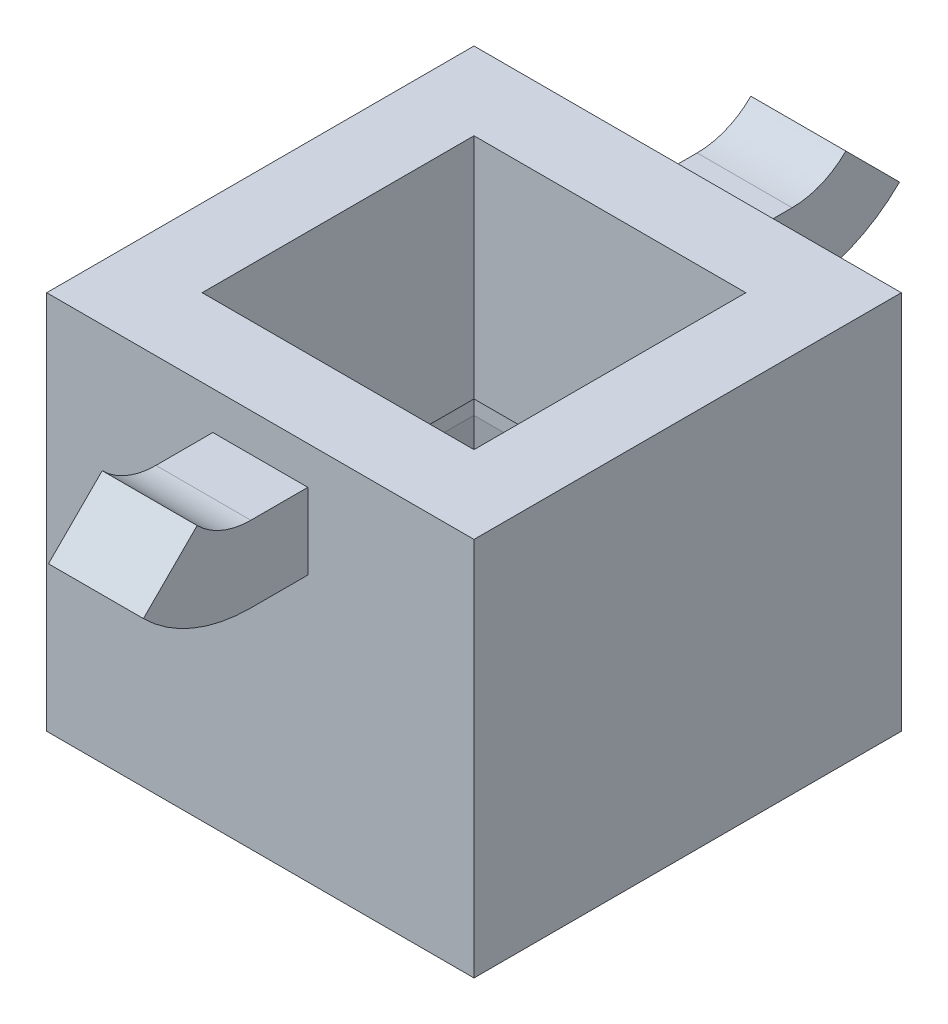
ISO-10303-21;
HEADER;
FILE_DESCRIPTION(('STEP AP214'),'2;1');
FILE_NAME('part.step','',(''),(''),'','','');
FILE_SCHEMA(('AUTOMOTIVE_DESIGN { 1 0 10303 214 1 1 1 1 }'));
ENDSEC;
DATA;
#1=APPLICATION_CONTEXT('core data for automotive mechanical design processes');
#2=APPLICATION_PROTOCOL_DEFINITION('international standard','automotive_design',2000,#1);
#3=PRODUCT_CONTEXT('',#1,'mechanical');
#4=PRODUCT('Part','Part','',(#3));
#5=PRODUCT_RELATED_PRODUCT_CATEGORY('part','',(#4));
#6=PRODUCT_DEFINITION_FORMATION('','',#4);
#7=PRODUCT_DEFINITION_CONTEXT('part definition',#1,'design');
#8=PRODUCT_DEFINITION('design','',#6,#7);
#9=PRODUCT_DEFINITION_SHAPE('','',#8);
#10=(LENGTH_UNIT() NAMED_UNIT(*) SI_UNIT(.MILLI.,.METRE.));
#11=(NAMED_UNIT(*) PLANE_ANGLE_UNIT() SI_UNIT($,.RADIAN.));
#12=(NAMED_UNIT(*) SI_UNIT($,.STERADIAN.) SOLID_ANGLE_UNIT());
#13=UNCERTAINTY_MEASURE_WITH_UNIT(LENGTH_MEASURE(1.E-05),#10,'distance_accuracy_value','');
#14=(GEOMETRIC_REPRESENTATION_CONTEXT(3) GLOBAL_UNCERTAINTY_ASSIGNED_CONTEXT((#13)) GLOBAL_UNIT_ASSIGNED_CONTEXT((#10,
#11,#12)) REPRESENTATION_CONTEXT('',''));
#15=CARTESIAN_POINT('',(0.,0.,0.));
#16=DIRECTION('',(0.,0.,1.));
#17=DIRECTION('',(1.,0.,0.));
#18=AXIS2_PLACEMENT_3D('',#15,#16,#17);
#19=CARTESIAN_POINT('',(11.25,20.,-11.25));
#20=DIRECTION('',(0.,0.,1.));
#21=DIRECTION('',(1.,0.,0.));
#22=AXIS2_PLACEMENT_3D('',#19,#20,#21);
#23=PLANE('',#22);
#24=DIRECTION('',(-1.,0.,0.));
#25=VECTOR('',#24,1.);
#26=CARTESIAN_POINT('',(11.25,0.,-11.25));
#27=LINE('',#26,#25);
#28=CARTESIAN_POINT('',(11.25,0.,-11.25));
#29=VERTEX_POINT('',#28);
#30=CARTESIAN_POINT('',(-11.25,0.,-11.25));
#31=VERTEX_POINT('',#30);
#32=EDGE_CURVE('E398',#29,#31,#27,.T.);
#33=ORIENTED_EDGE('',*,*,#32,.T.);
#34=DIRECTION('',(0.,-1.,0.));
#35=VECTOR('',#34,1.);
#36=CARTESIAN_POINT('',(-11.25,20.,-11.25));
#37=LINE('',#36,#35);
#38=CARTESIAN_POINT('',(-11.25,20.,-11.25));
#39=VERTEX_POINT('',#38);
#40=EDGE_CURVE('E404',#39,#31,#37,.T.);
#41=ORIENTED_EDGE('',*,*,#40,.F.);
#42=DIRECTION('',(-1.,0.,0.));
#43=VECTOR('',#42,1.);
#44=CARTESIAN_POINT('',(11.25,20.,-11.25));
#45=LINE('',#44,#43);
#46=CARTESIAN_POINT('',(11.25,20.,-11.25));
#47=VERTEX_POINT('',#46);
#48=EDGE_CURVE('E402',#47,#39,#45,.T.);
#49=ORIENTED_EDGE('',*,*,#48,.F.);
#50=DIRECTION('',(0.,-1.,0.));
#51=VECTOR('',#50,1.);
#52=CARTESIAN_POINT('',(11.25,20.,-11.25));
#53=LINE('',#52,#51);
#54=EDGE_CURVE('E414',#47,#29,#53,.T.);
#55=ORIENTED_EDGE('',*,*,#54,.T.);
#56=EDGE_LOOP('',(#33,#41,#49,#55));
#57=FACE_BOUND('',#56,.T.);
#58=DIRECTION('',(0.,-1.,0.));
#59=VECTOR('',#58,1.);
#60=CARTESIAN_POINT('',(2.50000000000001,18.,-11.25));
#61=LINE('',#60,#59);
#62=CARTESIAN_POINT('',(2.50000000000001,18.,-11.25));
#63=VERTEX_POINT('',#62);
#64=CARTESIAN_POINT('',(2.50000000000001,14.,-11.25));
#65=VERTEX_POINT('',#64);
#66=EDGE_CURVE('E339',#63,#65,#61,.T.);
#67=ORIENTED_EDGE('',*,*,#66,.F.);
#68=DIRECTION('',(1.,0.,0.));
#69=VECTOR('',#68,1.);
#70=CARTESIAN_POINT('',(-2.49999999999999,18.,-11.25));
#71=LINE('',#70,#69);
#72=CARTESIAN_POINT('',(-2.5,18.,-11.25));
#73=VERTEX_POINT('',#72);
#74=EDGE_CURVE('E344',#73,#63,#71,.T.);
#75=ORIENTED_EDGE('',*,*,#74,.F.);
#76=DIRECTION('',(0.,1.,0.));
#77=VECTOR('',#76,1.);
#78=CARTESIAN_POINT('',(-2.49999999999999,18.,-11.25));
#79=LINE('',#78,#77);
#80=CARTESIAN_POINT('',(-2.5,14.,-11.25));
#81=VERTEX_POINT('',#80);
#82=EDGE_CURVE('E353',#81,#73,#79,.T.);
#83=ORIENTED_EDGE('',*,*,#82,.F.);
#84=DIRECTION('',(-1.,0.,0.));
#85=VECTOR('',#84,1.);
#86=CARTESIAN_POINT('',(-2.49999999999999,14.,-11.25));
#87=LINE('',#86,#85);
#88=EDGE_CURVE('E350',#65,#81,#87,.T.);
#89=ORIENTED_EDGE('',*,*,#88,.F.);
#90=EDGE_LOOP('',(#67,#75,#83,#89));
#91=FACE_BOUND('',#90,.T.);
#92=ADVANCED_FACE('F33',(#57,#91),#23,.F.);
#93=CARTESIAN_POINT('',(-11.25,20.,11.25));
#94=DIRECTION('',(1.,0.,0.));
#95=DIRECTION('',(0.,0.,-1.));
#96=AXIS2_PLACEMENT_3D('',#93,#94,#95);
#97=PLANE('',#96);
#98=DIRECTION('',(0.,0.,1.));
#99=VECTOR('',#98,1.);
#100=CARTESIAN_POINT('',(-11.25,0.,11.25));
#101=LINE('',#100,#99);
#102=CARTESIAN_POINT('',(-11.25,0.,11.25));
#103=VERTEX_POINT('',#102);
#104=EDGE_CURVE('E393',#31,#103,#101,.T.);
#105=ORIENTED_EDGE('',*,*,#104,.T.);
#106=DIRECTION('',(0.,-1.,0.));
#107=VECTOR('',#106,1.);
#108=CARTESIAN_POINT('',(-11.25,20.,11.25));
#109=LINE('',#108,#107);
#110=CARTESIAN_POINT('',(-11.25,20.,11.25));
#111=VERTEX_POINT('',#110);
#112=EDGE_CURVE('E11',#111,#103,#109,.T.);
#113=ORIENTED_EDGE('',*,*,#112,.F.);
#114=DIRECTION('',(0.,0.,1.));
#115=VECTOR('',#114,1.);
#116=CARTESIAN_POINT('',(-11.25,20.,11.25));
#117=LINE('',#116,#115);
#118=EDGE_CURVE('E394',#39,#111,#117,.T.);
#119=ORIENTED_EDGE('',*,*,#118,.F.);
#120=ORIENTED_EDGE('',*,*,#40,.T.);
#121=EDGE_LOOP('',(#105,#113,#119,#120));
#122=FACE_BOUND('',#121,.T.);
#123=ADVANCED_FACE('F35',(#122),#97,.F.);
#124=CARTESIAN_POINT('',(11.25,20.,11.25));
#125=DIRECTION('',(0.,0.,-1.));
#126=DIRECTION('',(-1.,0.,0.));
#127=AXIS2_PLACEMENT_3D('',#124,#125,#126);
#128=PLANE('',#127);
#129=DIRECTION('',(1.,0.,0.));
#130=VECTOR('',#129,1.);
#131=CARTESIAN_POINT('',(-2.49999999999999,18.,11.25));
#132=LINE('',#131,#130);
#133=CARTESIAN_POINT('',(-2.49999999999999,18.,11.25));
#134=VERTEX_POINT('',#133);
#135=CARTESIAN_POINT('',(2.50000000000001,18.,11.25));
#136=VERTEX_POINT('',#135);
#137=EDGE_CURVE('E303',#134,#136,#132,.T.);
#138=ORIENTED_EDGE('',*,*,#137,.T.);
#139=DIRECTION('',(0.,-1.,0.));
#140=VECTOR('',#139,1.);
#141=CARTESIAN_POINT('',(2.50000000000001,18.,11.25));
#142=LINE('',#141,#140);
#143=CARTESIAN_POINT('',(2.5,14.,11.25));
#144=VERTEX_POINT('',#143);
#145=EDGE_CURVE('E275',#136,#144,#142,.T.);
#146=ORIENTED_EDGE('',*,*,#145,.T.);
#147=DIRECTION('',(-1.,0.,0.));
#148=VECTOR('',#147,1.);
#149=CARTESIAN_POINT('',(-2.49999999999999,14.,11.25));
#150=LINE('',#149,#148);
#151=CARTESIAN_POINT('',(-2.5,14.,11.25));
#152=VERTEX_POINT('',#151);
#153=EDGE_CURVE('E297',#144,#152,#150,.T.);
#154=ORIENTED_EDGE('',*,*,#153,.T.);
#155=DIRECTION('',(0.,1.,0.));
#156=VECTOR('',#155,1.);
#157=CARTESIAN_POINT('',(-2.49999999999999,18.,11.25));
#158=LINE('',#157,#156);
#159=EDGE_CURVE('E306',#152,#134,#158,.T.);
#160=ORIENTED_EDGE('',*,*,#159,.T.);
#161=EDGE_LOOP('',(#138,#146,#154,#160));
#162=FACE_BOUND('',#161,.T.);
#163=DIRECTION('',(1.,0.,0.));
#164=VECTOR('',#163,1.);
#165=CARTESIAN_POINT('',(11.25,0.,11.25));
#166=LINE('',#165,#164);
#167=CARTESIAN_POINT('',(11.25,0.,11.25));
#168=VERTEX_POINT('',#167);
#169=EDGE_CURVE('E407',#103,#168,#166,.T.);
#170=ORIENTED_EDGE('',*,*,#169,.T.);
#171=DIRECTION('',(0.,-1.,0.));
#172=VECTOR('',#171,1.);
#173=CARTESIAN_POINT('',(11.25,20.,11.25));
#174=LINE('',#173,#172);
#175=CARTESIAN_POINT('',(11.25,20.,11.25));
#176=VERTEX_POINT('',#175);
#177=EDGE_CURVE('E41',#176,#168,#174,.T.);
#178=ORIENTED_EDGE('',*,*,#177,.F.);
#179=DIRECTION('',(1.,0.,0.));
#180=VECTOR('',#179,1.);
#181=CARTESIAN_POINT('',(11.25,20.,11.25));
#182=LINE('',#181,#180);
#183=EDGE_CURVE('E397',#111,#176,#182,.T.);
#184=ORIENTED_EDGE('',*,*,#183,.F.);
#185=ORIENTED_EDGE('',*,*,#112,.T.);
#186=EDGE_LOOP('',(#170,#178,#184,#185));
#187=FACE_BOUND('',#186,.T.);
#188=ADVANCED_FACE('F435',(#162,#187),#128,.F.);
#189=CARTESIAN_POINT('',(11.25,20.,11.25));
#190=DIRECTION('',(-1.,0.,0.));
#191=DIRECTION('',(0.,0.,1.));
#192=AXIS2_PLACEMENT_3D('',#189,#190,#191);
#193=PLANE('',#192);
#194=DIRECTION('',(0.,0.,-1.));
#195=VECTOR('',#194,1.);
#196=CARTESIAN_POINT('',(11.25,0.,11.25));
#197=LINE('',#196,#195);
#198=EDGE_CURVE('E409',#168,#29,#197,.T.);
#199=ORIENTED_EDGE('',*,*,#198,.T.);
#200=ORIENTED_EDGE('',*,*,#54,.F.);
#201=DIRECTION('',(0.,0.,-1.));
#202=VECTOR('',#201,1.);
#203=CARTESIAN_POINT('',(11.25,20.,11.25));
#204=LINE('',#203,#202);
#205=EDGE_CURVE('E400',#176,#47,#204,.T.);
#206=ORIENTED_EDGE('',*,*,#205,.F.);
#207=ORIENTED_EDGE('',*,*,#177,.T.);
#208=EDGE_LOOP('',(#199,#200,#206,#207));
#209=FACE_BOUND('',#208,.T.);
#210=ADVANCED_FACE('F421',(#209),#193,.F.);
#211=CARTESIAN_POINT('',(0.,20.,0.));
#212=DIRECTION('',(0.,1.,0.));
#213=DIRECTION('',(0.,0.,1.));
#214=AXIS2_PLACEMENT_3D('',#211,#212,#213);
#215=PLANE('',#214);
#216=DIRECTION('',(0.,0.,-1.));
#217=VECTOR('',#216,1.);
#218=CARTESIAN_POINT('',(-7.15675499178565,20.,-7.15675499178565));
#219=LINE('',#218,#217);
#220=CARTESIAN_POINT('',(-7.15675499178565,20.,7.15675499178565));
#221=VERTEX_POINT('',#220);
#222=CARTESIAN_POINT('',(-7.15675499178565,20.,-7.15675499178565));
#223=VERTEX_POINT('',#222);
#224=EDGE_CURVE('E216',#221,#223,#219,.T.);
#225=ORIENTED_EDGE('',*,*,#224,.T.);
#226=DIRECTION('',(1.,0.,0.));
#227=VECTOR('',#226,1.);
#228=CARTESIAN_POINT('',(7.15675499178565,20.,-7.15675499178565));
#229=LINE('',#228,#227);
#230=CARTESIAN_POINT('',(7.15675499178565,20.,-7.15675499178565));
#231=VERTEX_POINT('',#230);
#232=EDGE_CURVE('E205',#223,#231,#229,.T.);
#233=ORIENTED_EDGE('',*,*,#232,.T.);
#234=DIRECTION('',(0.,0.,1.));
#235=VECTOR('',#234,1.);
#236=CARTESIAN_POINT('',(7.15675499178565,20.,-7.15675499178565));
#237=LINE('',#236,#235);
#238=CARTESIAN_POINT('',(7.15675499178565,20.,7.15675499178565));
#239=VERTEX_POINT('',#238);
#240=EDGE_CURVE('E227',#231,#239,#237,.T.);
#241=ORIENTED_EDGE('',*,*,#240,.T.);
#242=DIRECTION('',(-1.,0.,0.));
#243=VECTOR('',#242,1.);
#244=CARTESIAN_POINT('',(7.15675499178565,20.,7.15675499178565));
#245=LINE('',#244,#243);
#246=EDGE_CURVE('E223',#239,#221,#245,.T.);
#247=ORIENTED_EDGE('',*,*,#246,.T.);
#248=EDGE_LOOP('',(#225,#233,#241,#247));
#249=FACE_BOUND('',#248,.T.);
#250=ORIENTED_EDGE('',*,*,#118,.T.);
#251=ORIENTED_EDGE('',*,*,#183,.T.);
#252=ORIENTED_EDGE('',*,*,#205,.T.);
#253=ORIENTED_EDGE('',*,*,#48,.T.);
#254=EDGE_LOOP('',(#250,#251,#252,#253));
#255=FACE_BOUND('',#254,.T.);
#256=ADVANCED_FACE('F221',(#249,#255),#215,.T.);
#257=CARTESIAN_POINT('',(0.,0.,0.));
#258=DIRECTION('',(0.,1.,0.));
#259=DIRECTION('',(0.,0.,1.));
#260=AXIS2_PLACEMENT_3D('',#257,#258,#259);
#261=PLANE('',#260);
#262=DIRECTION('',(-1.,0.,0.));
#263=VECTOR('',#262,1.);
#264=CARTESIAN_POINT('',(-9.25,0.,9.25));
#265=LINE('',#264,#263);
#266=CARTESIAN_POINT('',(9.25,0.,9.25));
#267=VERTEX_POINT('',#266);
#268=CARTESIAN_POINT('',(-9.25,0.,9.25));
#269=VERTEX_POINT('',#268);
#270=EDGE_CURVE('E263',#267,#269,#265,.T.);
#271=ORIENTED_EDGE('',*,*,#270,.F.);
#272=DIRECTION('',(0.,0.,1.));
#273=VECTOR('',#272,1.);
#274=CARTESIAN_POINT('',(9.25,0.,-9.25));
#275=LINE('',#274,#273);
#276=CARTESIAN_POINT('',(9.25,0.,-9.25));
#277=VERTEX_POINT('',#276);
#278=EDGE_CURVE('E255',#277,#267,#275,.T.);
#279=ORIENTED_EDGE('',*,*,#278,.F.);
#280=DIRECTION('',(1.,0.,0.));
#281=VECTOR('',#280,1.);
#282=CARTESIAN_POINT('',(-9.25,0.,-9.25));
#283=LINE('',#282,#281);
#284=CARTESIAN_POINT('',(-9.25,0.,-9.25));
#285=VERTEX_POINT('',#284);
#286=EDGE_CURVE('E269',#285,#277,#283,.T.);
#287=ORIENTED_EDGE('',*,*,#286,.F.);
#288=DIRECTION('',(0.,0.,-1.));
#289=VECTOR('',#288,1.);
#290=CARTESIAN_POINT('',(-9.25,0.,-9.25));
#291=LINE('',#290,#289);
#292=EDGE_CURVE('E266',#269,#285,#291,.T.);
#293=ORIENTED_EDGE('',*,*,#292,.F.);
#294=EDGE_LOOP('',(#271,#279,#287,#293));
#295=FACE_BOUND('',#294,.T.);
#296=ORIENTED_EDGE('',*,*,#104,.F.);
#297=ORIENTED_EDGE('',*,*,#32,.F.);
#298=ORIENTED_EDGE('',*,*,#198,.F.);
#299=ORIENTED_EDGE('',*,*,#169,.F.);
#300=EDGE_LOOP('',(#296,#297,#298,#299));
#301=FACE_BOUND('',#300,.T.);
#302=ADVANCED_FACE('F427',(#295,#301),#261,.F.);
#303=CARTESIAN_POINT('',(0.,22.,-14.25));
#304=DIRECTION('',(1.,0.,0.));
#305=DIRECTION('',(0.,0.,-1.));
#306=AXIS2_PLACEMENT_3D('',#303,#304,#305);
#307=CYLINDRICAL_SURFACE('',#306,8.);
#308=DIRECTION('',(-1.,0.,0.));
#309=VECTOR('',#308,1.);
#310=CARTESIAN_POINT('',(-2.49999999999999,14.,-14.25));
#311=LINE('',#310,#309);
#312=CARTESIAN_POINT('',(2.5,14.,-14.25));
#313=VERTEX_POINT('',#312);
#314=CARTESIAN_POINT('',(-2.49999999999999,14.,-14.25));
#315=VERTEX_POINT('',#314);
#316=EDGE_CURVE('E340',#313,#315,#311,.T.);
#317=ORIENTED_EDGE('',*,*,#316,.T.);
#318=CARTESIAN_POINT('',(-2.49999999999999,22.,-14.25));
#319=DIRECTION('',(1.,0.,0.));
#320=DIRECTION('',(0.,0.,-1.));
#321=AXIS2_PLACEMENT_3D('',#318,#319,#320);
#322=CIRCLE('',#321,8.);
#323=CARTESIAN_POINT('',(-2.49999999999999,16.3431457505076,-19.9068542494923));
#324=VERTEX_POINT('',#323);
#325=EDGE_CURVE('E387',#315,#324,#322,.T.);
#326=ORIENTED_EDGE('',*,*,#325,.T.);
#327=DIRECTION('',(-1.,0.,0.));
#328=VECTOR('',#327,1.);
#329=CARTESIAN_POINT('',(-2.49999999999999,16.3431457505076,-19.9068542494923));
#330=LINE('',#329,#328);
#331=CARTESIAN_POINT('',(2.5,16.3431457505076,-19.9068542494923));
#332=VERTEX_POINT('',#331);
#333=EDGE_CURVE('E378',#332,#324,#330,.T.);
#334=ORIENTED_EDGE('',*,*,#333,.F.);
#335=CARTESIAN_POINT('',(2.5,22.,-14.25));
#336=DIRECTION('',(1.,0.,0.));
#337=DIRECTION('',(0.,0.,-1.));
#338=AXIS2_PLACEMENT_3D('',#335,#336,#337);
#339=CIRCLE('',#338,8.);
#340=EDGE_CURVE('E390',#313,#332,#339,.T.);
#341=ORIENTED_EDGE('',*,*,#340,.F.);
#342=EDGE_LOOP('',(#317,#326,#334,#341));
#343=FACE_BOUND('',#342,.T.);
#344=ADVANCED_FACE('F450',(#343),#307,.T.);
#345=CARTESIAN_POINT('',(0.,22.,-14.25));
#346=DIRECTION('',(1.,0.,0.));
#347=DIRECTION('',(0.,0.,-1.));
#348=AXIS2_PLACEMENT_3D('',#345,#346,#347);
#349=CYLINDRICAL_SURFACE('',#348,4.);
#350=DIRECTION('',(1.,0.,0.));
#351=VECTOR('',#350,1.);
#352=CARTESIAN_POINT('',(-2.49999999999999,18.,-14.25));
#353=LINE('',#352,#351);
#354=CARTESIAN_POINT('',(-2.49999999999999,18.,-14.25));
#355=VERTEX_POINT('',#354);
#356=CARTESIAN_POINT('',(2.50000000000001,18.,-14.25));
#357=VERTEX_POINT('',#356);
#358=EDGE_CURVE('E343',#355,#357,#353,.T.);
#359=ORIENTED_EDGE('',*,*,#358,.T.);
#360=CARTESIAN_POINT('',(2.50000000000001,22.,-14.25));
#361=DIRECTION('',(1.,0.,0.));
#362=DIRECTION('',(0.,0.,-1.));
#363=AXIS2_PLACEMENT_3D('',#360,#361,#362);
#364=CIRCLE('',#363,4.);
#365=CARTESIAN_POINT('',(2.50000000000001,19.1715728752538,-17.0784271247462));
#366=VERTEX_POINT('',#365);
#367=EDGE_CURVE('E381',#357,#366,#364,.T.);
#368=ORIENTED_EDGE('',*,*,#367,.T.);
#369=DIRECTION('',(1.,0.,0.));
#370=VECTOR('',#369,1.);
#371=CARTESIAN_POINT('',(-2.49999999999999,19.1715728752538,-17.0784271247462));
#372=LINE('',#371,#370);
#373=CARTESIAN_POINT('',(-2.49999999999999,19.1715728752538,-17.0784271247462));
#374=VERTEX_POINT('',#373);
#375=EDGE_CURVE('E372',#374,#366,#372,.T.);
#376=ORIENTED_EDGE('',*,*,#375,.F.);
#377=CARTESIAN_POINT('',(-2.49999999999999,22.,-14.25));
#378=DIRECTION('',(1.,0.,0.));
#379=DIRECTION('',(0.,0.,-1.));
#380=AXIS2_PLACEMENT_3D('',#377,#378,#379);
#381=CIRCLE('',#380,4.);
#382=EDGE_CURVE('E384',#355,#374,#381,.T.);
#383=ORIENTED_EDGE('',*,*,#382,.F.);
#384=EDGE_LOOP('',(#359,#368,#376,#383));
#385=FACE_BOUND('',#384,.T.);
#386=ADVANCED_FACE('F456',(#385),#349,.F.);
#387=CARTESIAN_POINT('',(2.50000000000001,18.,-14.25));
#388=DIRECTION('',(-1.,0.,0.));
#389=DIRECTION('',(0.,-1.,0.));
#390=AXIS2_PLACEMENT_3D('',#387,#388,#389);
#391=PLANE('',#390);
#392=ORIENTED_EDGE('',*,*,#66,.T.);
#393=DIRECTION('',(0.,0.,1.));
#394=VECTOR('',#393,1.);
#395=CARTESIAN_POINT('',(2.5,14.,-14.25));
#396=LINE('',#395,#394);
#397=EDGE_CURVE('E366',#313,#65,#396,.T.);
#398=ORIENTED_EDGE('',*,*,#397,.F.);
#399=ORIENTED_EDGE('',*,*,#340,.T.);
#400=DIRECTION('',(0.,-0.707106781186554,-0.707106781186541));
#401=VECTOR('',#400,1.);
#402=CARTESIAN_POINT('',(2.50000000000001,19.1715728752538,-17.0784271247462));
#403=LINE('',#402,#401);
#404=EDGE_CURVE('E369',#366,#332,#403,.T.);
#405=ORIENTED_EDGE('',*,*,#404,.F.);
#406=ORIENTED_EDGE('',*,*,#367,.F.);
#407=DIRECTION('',(0.,0.,1.));
#408=VECTOR('',#407,1.);
#409=CARTESIAN_POINT('',(2.50000000000001,18.,-14.25));
#410=LINE('',#409,#408);
#411=EDGE_CURVE('E347',#357,#63,#410,.T.);
#412=ORIENTED_EDGE('',*,*,#411,.T.);
#413=EDGE_LOOP('',(#392,#398,#399,#405,#406,#412));
#414=FACE_BOUND('',#413,.T.);
#415=ADVANCED_FACE('F460',(#414),#391,.F.);
#416=CARTESIAN_POINT('',(-2.49999999999999,14.,-14.25));
#417=DIRECTION('',(0.,1.,0.));
#418=DIRECTION('',(0.,0.,1.));
#419=AXIS2_PLACEMENT_3D('',#416,#417,#418);
#420=PLANE('',#419);
#421=ORIENTED_EDGE('',*,*,#88,.T.);
#422=DIRECTION('',(0.,0.,1.));
#423=VECTOR('',#422,1.);
#424=CARTESIAN_POINT('',(-2.49999999999999,14.,-14.25));
#425=LINE('',#424,#423);
#426=EDGE_CURVE('E363',#315,#81,#425,.T.);
#427=ORIENTED_EDGE('',*,*,#426,.F.);
#428=ORIENTED_EDGE('',*,*,#316,.F.);
#429=ORIENTED_EDGE('',*,*,#397,.T.);
#430=EDGE_LOOP('',(#421,#427,#428,#429));
#431=FACE_BOUND('',#430,.T.);
#432=ADVANCED_FACE('F464',(#431),#420,.F.);
#433=CARTESIAN_POINT('',(-2.49999999999999,18.,-14.25));
#434=DIRECTION('',(1.,0.,0.));
#435=DIRECTION('',(0.,0.,-1.));
#436=AXIS2_PLACEMENT_3D('',#433,#434,#435);
#437=PLANE('',#436);
#438=ORIENTED_EDGE('',*,*,#82,.T.);
#439=DIRECTION('',(0.,0.,1.));
#440=VECTOR('',#439,1.);
#441=CARTESIAN_POINT('',(-2.49999999999999,18.,-14.25));
#442=LINE('',#441,#440);
#443=EDGE_CURVE('E360',#355,#73,#442,.T.);
#444=ORIENTED_EDGE('',*,*,#443,.F.);
#445=ORIENTED_EDGE('',*,*,#382,.T.);
#446=DIRECTION('',(0.,0.707106781186554,0.707106781186541));
#447=VECTOR('',#446,1.);
#448=CARTESIAN_POINT('',(-2.49999999999999,19.1715728752538,-17.0784271247462));
#449=LINE('',#448,#447);
#450=EDGE_CURVE('E375',#324,#374,#449,.T.);
#451=ORIENTED_EDGE('',*,*,#450,.F.);
#452=ORIENTED_EDGE('',*,*,#325,.F.);
#453=ORIENTED_EDGE('',*,*,#426,.T.);
#454=EDGE_LOOP('',(#438,#444,#445,#451,#452,#453));
#455=FACE_BOUND('',#454,.T.);
#456=ADVANCED_FACE('F468',(#455),#437,.F.);
#457=CARTESIAN_POINT('',(-2.49999999999999,18.,-14.25));
#458=DIRECTION('',(0.,-1.,0.));
#459=DIRECTION('',(0.,0.,-1.));
#460=AXIS2_PLACEMENT_3D('',#457,#458,#459);
#461=PLANE('',#460);
#462=ORIENTED_EDGE('',*,*,#74,.T.);
#463=ORIENTED_EDGE('',*,*,#411,.F.);
#464=ORIENTED_EDGE('',*,*,#358,.F.);
#465=ORIENTED_EDGE('',*,*,#443,.T.);
#466=EDGE_LOOP('',(#462,#463,#464,#465));
#467=FACE_BOUND('',#466,.T.);
#468=ADVANCED_FACE('F472',(#467),#461,.F.);
#469=CARTESIAN_POINT('',(0.,6.4436508138958,-29.8063491861039));
#470=DIRECTION('',(0.,-0.707106781186541,0.707106781186554));
#471=DIRECTION('',(1.,0.,0.));
#472=AXIS2_PLACEMENT_3D('',#469,#470,#471);
#473=PLANE('',#472);
#474=ORIENTED_EDGE('',*,*,#404,.T.);
#475=ORIENTED_EDGE('',*,*,#333,.T.);
#476=ORIENTED_EDGE('',*,*,#450,.T.);
#477=ORIENTED_EDGE('',*,*,#375,.T.);
#478=EDGE_LOOP('',(#474,#475,#476,#477));
#479=FACE_BOUND('',#478,.T.);
#480=ADVANCED_FACE('F476',(#479),#473,.F.);
#481=CARTESIAN_POINT('',(0.,22.,14.25));
#482=DIRECTION('',(-1.,0.,0.));
#483=DIRECTION('',(0.,0.,1.));
#484=AXIS2_PLACEMENT_3D('',#481,#482,#483);
#485=CYLINDRICAL_SURFACE('',#484,4.);
#486=DIRECTION('',(1.,0.,0.));
#487=VECTOR('',#486,1.);
#488=CARTESIAN_POINT('',(-2.49999999999999,18.,14.25));
#489=LINE('',#488,#487);
#490=CARTESIAN_POINT('',(-2.49999999999999,18.,14.25));
#491=VERTEX_POINT('',#490);
#492=CARTESIAN_POINT('',(2.50000000000001,18.,14.25));
#493=VERTEX_POINT('',#492);
#494=EDGE_CURVE('E293',#491,#493,#489,.T.);
#495=ORIENTED_EDGE('',*,*,#494,.F.);
#496=CARTESIAN_POINT('',(-2.49999999999999,22.,14.25));
#497=DIRECTION('',(-1.,0.,0.));
#498=DIRECTION('',(0.,0.,1.));
#499=AXIS2_PLACEMENT_3D('',#496,#497,#498);
#500=CIRCLE('',#499,4.);
#501=CARTESIAN_POINT('',(-2.49999999999999,19.1715728752538,17.0784271247462));
#502=VERTEX_POINT('',#501);
#503=EDGE_CURVE('E333',#491,#502,#500,.T.);
#504=ORIENTED_EDGE('',*,*,#503,.T.);
#505=DIRECTION('',(1.,0.,0.));
#506=VECTOR('',#505,1.);
#507=CARTESIAN_POINT('',(-2.49999999999999,19.1715728752538,17.0784271247462));
#508=LINE('',#507,#506);
#509=CARTESIAN_POINT('',(2.50000000000001,19.1715728752538,17.0784271247462));
#510=VERTEX_POINT('',#509);
#511=EDGE_CURVE('E325',#502,#510,#508,.T.);
#512=ORIENTED_EDGE('',*,*,#511,.T.);
#513=CARTESIAN_POINT('',(2.50000000000001,22.,14.25));
#514=DIRECTION('',(-1.,0.,0.));
#515=DIRECTION('',(0.,0.,1.));
#516=AXIS2_PLACEMENT_3D('',#513,#514,#515);
#517=CIRCLE('',#516,4.);
#518=EDGE_CURVE('E336',#493,#510,#517,.T.);
#519=ORIENTED_EDGE('',*,*,#518,.F.);
#520=EDGE_LOOP('',(#495,#504,#512,#519));
#521=FACE_BOUND('',#520,.T.);
#522=ADVANCED_FACE('F480',(#521),#485,.F.);
#523=CARTESIAN_POINT('',(0.,22.,14.25));
#524=DIRECTION('',(-1.,0.,0.));
#525=DIRECTION('',(0.,0.,1.));
#526=AXIS2_PLACEMENT_3D('',#523,#524,#525);
#527=CYLINDRICAL_SURFACE('',#526,8.);
#528=DIRECTION('',(-1.,0.,0.));
#529=VECTOR('',#528,1.);
#530=CARTESIAN_POINT('',(-2.49999999999999,14.,14.25));
#531=LINE('',#530,#529);
#532=CARTESIAN_POINT('',(2.5,14.,14.25));
#533=VERTEX_POINT('',#532);
#534=CARTESIAN_POINT('',(-2.49999999999999,14.,14.25));
#535=VERTEX_POINT('',#534);
#536=EDGE_CURVE('E296',#533,#535,#531,.T.);
#537=ORIENTED_EDGE('',*,*,#536,.F.);
#538=CARTESIAN_POINT('',(2.5,22.,14.25));
#539=DIRECTION('',(-1.,0.,0.));
#540=DIRECTION('',(0.,0.,1.));
#541=AXIS2_PLACEMENT_3D('',#538,#539,#540);
#542=CIRCLE('',#541,8.);
#543=CARTESIAN_POINT('',(2.5,16.3431457505076,19.9068542494923));
#544=VERTEX_POINT('',#543);
#545=EDGE_CURVE('E327',#533,#544,#542,.T.);
#546=ORIENTED_EDGE('',*,*,#545,.T.);
#547=DIRECTION('',(-1.,0.,0.));
#548=VECTOR('',#547,1.);
#549=CARTESIAN_POINT('',(-2.49999999999999,16.3431457505076,19.9068542494923));
#550=LINE('',#549,#548);
#551=CARTESIAN_POINT('',(-2.49999999999999,16.3431457505076,19.9068542494923));
#552=VERTEX_POINT('',#551);
#553=EDGE_CURVE('E321',#544,#552,#550,.T.);
#554=ORIENTED_EDGE('',*,*,#553,.T.);
#555=CARTESIAN_POINT('',(-2.49999999999999,22.,14.25));
#556=DIRECTION('',(-1.,0.,0.));
#557=DIRECTION('',(0.,0.,1.));
#558=AXIS2_PLACEMENT_3D('',#555,#556,#557);
#559=CIRCLE('',#558,8.);
#560=EDGE_CURVE('E330',#535,#552,#559,.T.);
#561=ORIENTED_EDGE('',*,*,#560,.F.);
#562=EDGE_LOOP('',(#537,#546,#554,#561));
#563=FACE_BOUND('',#562,.T.);
#564=ADVANCED_FACE('F484',(#563),#527,.T.);
#565=CARTESIAN_POINT('',(2.50000000000001,18.,14.25));
#566=DIRECTION('',(1.,0.,0.));
#567=DIRECTION('',(0.,1.,0.));
#568=AXIS2_PLACEMENT_3D('',#565,#566,#567);
#569=PLANE('',#568);
#570=ORIENTED_EDGE('',*,*,#145,.F.);
#571=DIRECTION('',(0.,0.,-1.));
#572=VECTOR('',#571,1.);
#573=CARTESIAN_POINT('',(2.50000000000001,18.,14.25));
#574=LINE('',#573,#572);
#575=EDGE_CURVE('E317',#493,#136,#574,.T.);
#576=ORIENTED_EDGE('',*,*,#575,.F.);
#577=ORIENTED_EDGE('',*,*,#518,.T.);
#578=DIRECTION('',(0.,-0.707106781186554,0.707106781186541));
#579=VECTOR('',#578,1.);
#580=CARTESIAN_POINT('',(2.50000000000001,19.1715728752538,17.0784271247462));
#581=LINE('',#580,#579);
#582=EDGE_CURVE('E319',#510,#544,#581,.T.);
#583=ORIENTED_EDGE('',*,*,#582,.T.);
#584=ORIENTED_EDGE('',*,*,#545,.F.);
#585=DIRECTION('',(0.,0.,-1.));
#586=VECTOR('',#585,1.);
#587=CARTESIAN_POINT('',(2.5,14.,14.25));
#588=LINE('',#587,#586);
#589=EDGE_CURVE('E300',#533,#144,#588,.T.);
#590=ORIENTED_EDGE('',*,*,#589,.T.);
#591=EDGE_LOOP('',(#570,#576,#577,#583,#584,#590));
#592=FACE_BOUND('',#591,.T.);
#593=ADVANCED_FACE('F488',(#592),#569,.T.);
#594=CARTESIAN_POINT('',(-2.49999999999999,18.,14.25));
#595=DIRECTION('',(0.,1.,0.));
#596=DIRECTION('',(0.,0.,1.));
#597=AXIS2_PLACEMENT_3D('',#594,#595,#596);
#598=PLANE('',#597);
#599=ORIENTED_EDGE('',*,*,#137,.F.);
#600=DIRECTION('',(0.,0.,-1.));
#601=VECTOR('',#600,1.);
#602=CARTESIAN_POINT('',(-2.49999999999999,18.,14.25));
#603=LINE('',#602,#601);
#604=EDGE_CURVE('E315',#491,#134,#603,.T.);
#605=ORIENTED_EDGE('',*,*,#604,.F.);
#606=ORIENTED_EDGE('',*,*,#494,.T.);
#607=ORIENTED_EDGE('',*,*,#575,.T.);
#608=EDGE_LOOP('',(#599,#605,#606,#607));
#609=FACE_BOUND('',#608,.T.);
#610=ADVANCED_FACE('F492',(#609),#598,.T.);
#611=CARTESIAN_POINT('',(-2.49999999999999,18.,14.25));
#612=DIRECTION('',(-1.,0.,0.));
#613=DIRECTION('',(0.,0.,1.));
#614=AXIS2_PLACEMENT_3D('',#611,#612,#613);
#615=PLANE('',#614);
#616=ORIENTED_EDGE('',*,*,#159,.F.);
#617=DIRECTION('',(0.,0.,-1.));
#618=VECTOR('',#617,1.);
#619=CARTESIAN_POINT('',(-2.49999999999999,14.,14.25));
#620=LINE('',#619,#618);
#621=EDGE_CURVE('E312',#535,#152,#620,.T.);
#622=ORIENTED_EDGE('',*,*,#621,.F.);
#623=ORIENTED_EDGE('',*,*,#560,.T.);
#624=DIRECTION('',(0.,0.707106781186554,-0.707106781186541));
#625=VECTOR('',#624,1.);
#626=CARTESIAN_POINT('',(-2.49999999999999,19.1715728752538,17.0784271247462));
#627=LINE('',#626,#625);
#628=EDGE_CURVE('E323',#552,#502,#627,.T.);
#629=ORIENTED_EDGE('',*,*,#628,.T.);
#630=ORIENTED_EDGE('',*,*,#503,.F.);
#631=ORIENTED_EDGE('',*,*,#604,.T.);
#632=EDGE_LOOP('',(#616,#622,#623,#629,#630,#631));
#633=FACE_BOUND('',#632,.T.);
#634=ADVANCED_FACE('F496',(#633),#615,.T.);
#635=CARTESIAN_POINT('',(-2.49999999999999,14.,14.25));
#636=DIRECTION('',(0.,-1.,0.));
#637=DIRECTION('',(0.,0.,-1.));
#638=AXIS2_PLACEMENT_3D('',#635,#636,#637);
#639=PLANE('',#638);
#640=ORIENTED_EDGE('',*,*,#153,.F.);
#641=ORIENTED_EDGE('',*,*,#589,.F.);
#642=ORIENTED_EDGE('',*,*,#536,.T.);
#643=ORIENTED_EDGE('',*,*,#621,.T.);
#644=EDGE_LOOP('',(#640,#641,#642,#643));
#645=FACE_BOUND('',#644,.T.);
#646=ADVANCED_FACE('F500',(#645),#639,.T.);
#647=CARTESIAN_POINT('',(0.,6.4436508138958,29.8063491861039));
#648=DIRECTION('',(0.,-0.707106781186541,-0.707106781186554));
#649=DIRECTION('',(1.,0.,0.));
#650=AXIS2_PLACEMENT_3D('',#647,#648,#649);
#651=PLANE('',#650);
#652=ORIENTED_EDGE('',*,*,#582,.F.);
#653=ORIENTED_EDGE('',*,*,#511,.F.);
#654=ORIENTED_EDGE('',*,*,#628,.F.);
#655=ORIENTED_EDGE('',*,*,#553,.F.);
#656=EDGE_LOOP('',(#652,#653,#654,#655));
#657=FACE_BOUND('',#656,.T.);
#658=ADVANCED_FACE('F504',(#657),#651,.F.);
#659=CARTESIAN_POINT('',(9.25,0.,-9.25));
#660=DIRECTION('',(0.99026806874157,0.139173100960065,0.));
#661=DIRECTION('',(-0.139173100960065,0.99026806874157,0.));
#662=AXIS2_PLACEMENT_3D('',#659,#660,#661);
#663=PLANE('',#662);
#664=ORIENTED_EDGE('',*,*,#278,.T.);
#665=DIRECTION('',(0.137844537491629,-0.980814848463989,0.137844537491629));
#666=VECTOR('',#665,1.);
#667=CARTESIAN_POINT('',(8.8984793444488,2.50119942930165,8.8984793444488));
#668=LINE('',#667,#666);
#669=CARTESIAN_POINT('',(8.40675499178565,6.,8.40675499178565));
#670=VERTEX_POINT('',#669);
#671=EDGE_CURVE('E277',#670,#267,#668,.T.);
#672=ORIENTED_EDGE('',*,*,#671,.F.);
#673=DIRECTION('',(0.,0.,1.));
#674=VECTOR('',#673,1.);
#675=CARTESIAN_POINT('',(8.40675499178565,6.,-9.25));
#676=LINE('',#675,#674);
#677=CARTESIAN_POINT('',(8.40675499178565,6.,-8.40675499178565));
#678=VERTEX_POINT('',#677);
#679=EDGE_CURVE('E272',#678,#670,#676,.T.);
#680=ORIENTED_EDGE('',*,*,#679,.F.);
#681=DIRECTION('',(0.137844537491629,-0.980814848463989,-0.137844537491629));
#682=VECTOR('',#681,1.);
#683=CARTESIAN_POINT('',(8.8984793444488,2.50119942930165,-8.8984793444488));
#684=LINE('',#683,#682);
#685=EDGE_CURVE('E273',#678,#277,#684,.T.);
#686=ORIENTED_EDGE('',*,*,#685,.T.);
#687=EDGE_LOOP('',(#664,#672,#680,#686));
#688=FACE_BOUND('',#687,.T.);
#689=ADVANCED_FACE('F508',(#688),#663,.F.);
#690=CARTESIAN_POINT('',(-9.25,0.,-9.25));
#691=DIRECTION('',(0.,0.139173100960065,-0.99026806874157));
#692=DIRECTION('',(0.,0.99026806874157,0.139173100960065));
#693=AXIS2_PLACEMENT_3D('',#690,#691,#692);
#694=PLANE('',#693);
#695=ORIENTED_EDGE('',*,*,#286,.T.);
#696=ORIENTED_EDGE('',*,*,#685,.F.);
#697=DIRECTION('',(1.,0.,0.));
#698=VECTOR('',#697,1.);
#699=CARTESIAN_POINT('',(-9.25,6.,-8.40675499178565));
#700=LINE('',#699,#698);
#701=CARTESIAN_POINT('',(-8.40675499178565,6.,-8.40675499178565));
#702=VERTEX_POINT('',#701);
#703=EDGE_CURVE('E281',#702,#678,#700,.T.);
#704=ORIENTED_EDGE('',*,*,#703,.F.);
#705=DIRECTION('',(-0.137844537491629,-0.980814848463989,-0.137844537491629));
#706=VECTOR('',#705,1.);
#707=CARTESIAN_POINT('',(-9.25,0.,-9.25));
#708=LINE('',#707,#706);
#709=EDGE_CURVE('E276',#702,#285,#708,.T.);
#710=ORIENTED_EDGE('',*,*,#709,.T.);
#711=EDGE_LOOP('',(#695,#696,#704,#710));
#712=FACE_BOUND('',#711,.T.);
#713=ADVANCED_FACE('F510',(#712),#694,.F.);
#714=CARTESIAN_POINT('',(-9.25,0.,-9.25));
#715=DIRECTION('',(-0.99026806874157,0.139173100960065,0.));
#716=DIRECTION('',(-0.139173100960065,-0.99026806874157,0.));
#717=AXIS2_PLACEMENT_3D('',#714,#715,#716);
#718=PLANE('',#717);
#719=ORIENTED_EDGE('',*,*,#292,.T.);
#720=ORIENTED_EDGE('',*,*,#709,.F.);
#721=DIRECTION('',(0.,0.,-1.));
#722=VECTOR('',#721,1.);
#723=CARTESIAN_POINT('',(-8.40675499178565,6.,-9.25));
#724=LINE('',#723,#722);
#725=CARTESIAN_POINT('',(-8.40675499178565,6.,8.40675499178565));
#726=VERTEX_POINT('',#725);
#727=EDGE_CURVE('E289',#726,#702,#724,.T.);
#728=ORIENTED_EDGE('',*,*,#727,.F.);
#729=DIRECTION('',(-0.137844537491629,-0.980814848463989,0.137844537491629));
#730=VECTOR('',#729,1.);
#731=CARTESIAN_POINT('',(-9.25,0.,9.25));
#732=LINE('',#731,#730);
#733=EDGE_CURVE('E280',#726,#269,#732,.T.);
#734=ORIENTED_EDGE('',*,*,#733,.T.);
#735=EDGE_LOOP('',(#719,#720,#728,#734));
#736=FACE_BOUND('',#735,.T.);
#737=ADVANCED_FACE('F513',(#736),#718,.F.);
#738=CARTESIAN_POINT('',(-9.25,0.,9.25));
#739=DIRECTION('',(0.,0.139173100960065,0.99026806874157));
#740=DIRECTION('',(0.,-0.99026806874157,0.139173100960065));
#741=AXIS2_PLACEMENT_3D('',#738,#739,#740);
#742=PLANE('',#741);
#743=ORIENTED_EDGE('',*,*,#270,.T.);
#744=ORIENTED_EDGE('',*,*,#733,.F.);
#745=DIRECTION('',(-1.,0.,0.));
#746=VECTOR('',#745,1.);
#747=CARTESIAN_POINT('',(-9.25,6.,8.40675499178565));
#748=LINE('',#747,#746);
#749=EDGE_CURVE('E286',#670,#726,#748,.T.);
#750=ORIENTED_EDGE('',*,*,#749,.F.);
#751=ORIENTED_EDGE('',*,*,#671,.T.);
#752=EDGE_LOOP('',(#743,#744,#750,#751));
#753=FACE_BOUND('',#752,.T.);
#754=ADVANCED_FACE('F517',(#753),#742,.F.);
#755=CARTESIAN_POINT('',(-8.40675499178565,8.,8.40675499178565));
#756=DIRECTION('',(-1.,0.,0.));
#757=DIRECTION('',(0.,0.,1.));
#758=AXIS2_PLACEMENT_3D('',#755,#756,#757);
#759=PLANE('',#758);
#760=ORIENTED_EDGE('',*,*,#727,.T.);
#761=DIRECTION('',(0.,-1.,0.));
#762=VECTOR('',#761,1.);
#763=CARTESIAN_POINT('',(-8.40675499178565,8.,-8.40675499178565));
#764=LINE('',#763,#762);
#765=CARTESIAN_POINT('',(-8.40675499178565,8.,-8.40675499178565));
#766=VERTEX_POINT('',#765);
#767=EDGE_CURVE('E252',#766,#702,#764,.T.);
#768=ORIENTED_EDGE('',*,*,#767,.F.);
#769=DIRECTION('',(0.,0.,-1.));
#770=VECTOR('',#769,1.);
#771=CARTESIAN_POINT('',(-8.40675499178565,8.,8.40675499178565));
#772=LINE('',#771,#770);
#773=CARTESIAN_POINT('',(-8.40675499178565,8.,8.40675499178565));
#774=VERTEX_POINT('',#773);
#775=EDGE_CURVE('E212',#774,#766,#772,.T.);
#776=ORIENTED_EDGE('',*,*,#775,.F.);
#777=DIRECTION('',(0.,-1.,0.));
#778=VECTOR('',#777,1.);
#779=CARTESIAN_POINT('',(-8.40675499178565,8.,8.40675499178565));
#780=LINE('',#779,#778);
#781=EDGE_CURVE('E253',#774,#726,#780,.T.);
#782=ORIENTED_EDGE('',*,*,#781,.T.);
#783=EDGE_LOOP('',(#760,#768,#776,#782));
#784=FACE_BOUND('',#783,.T.);
#785=ADVANCED_FACE('F521',(#784),#759,.F.);
#786=CARTESIAN_POINT('',(8.40675499178565,8.,8.40675499178565));
#787=DIRECTION('',(0.,0.,1.));
#788=DIRECTION('',(1.,0.,0.));
#789=AXIS2_PLACEMENT_3D('',#786,#787,#788);
#790=PLANE('',#789);
#791=ORIENTED_EDGE('',*,*,#749,.T.);
#792=ORIENTED_EDGE('',*,*,#781,.F.);
#793=DIRECTION('',(-1.,0.,0.));
#794=VECTOR('',#793,1.);
#795=CARTESIAN_POINT('',(8.40675499178565,8.,8.40675499178565));
#796=LINE('',#795,#794);
#797=CARTESIAN_POINT('',(8.40675499178565,8.,8.40675499178565));
#798=VERTEX_POINT('',#797);
#799=EDGE_CURVE('E249',#798,#774,#796,.T.);
#800=ORIENTED_EDGE('',*,*,#799,.F.);
#801=DIRECTION('',(0.,-1.,0.));
#802=VECTOR('',#801,1.);
#803=CARTESIAN_POINT('',(8.40675499178565,8.,8.40675499178565));
#804=LINE('',#803,#802);
#805=EDGE_CURVE('E256',#798,#670,#804,.T.);
#806=ORIENTED_EDGE('',*,*,#805,.T.);
#807=EDGE_LOOP('',(#791,#792,#800,#806));
#808=FACE_BOUND('',#807,.T.);
#809=ADVANCED_FACE('F528',(#808),#790,.F.);
#810=CARTESIAN_POINT('',(8.40675499178565,8.,8.40675499178565));
#811=DIRECTION('',(1.,0.,0.));
#812=DIRECTION('',(0.,0.,-1.));
#813=AXIS2_PLACEMENT_3D('',#810,#811,#812);
#814=PLANE('',#813);
#815=ORIENTED_EDGE('',*,*,#679,.T.);
#816=ORIENTED_EDGE('',*,*,#805,.F.);
#817=DIRECTION('',(0.,0.,1.));
#818=VECTOR('',#817,1.);
#819=CARTESIAN_POINT('',(8.40675499178565,8.,8.40675499178565));
#820=LINE('',#819,#818);
#821=CARTESIAN_POINT('',(8.40675499178565,8.,-8.40675499178565));
#822=VERTEX_POINT('',#821);
#823=EDGE_CURVE('E246',#822,#798,#820,.T.);
#824=ORIENTED_EDGE('',*,*,#823,.F.);
#825=DIRECTION('',(0.,-1.,0.));
#826=VECTOR('',#825,1.);
#827=CARTESIAN_POINT('',(8.40675499178565,8.,-8.40675499178565));
#828=LINE('',#827,#826);
#829=EDGE_CURVE('E258',#822,#678,#828,.T.);
#830=ORIENTED_EDGE('',*,*,#829,.T.);
#831=EDGE_LOOP('',(#815,#816,#824,#830));
#832=FACE_BOUND('',#831,.T.);
#833=ADVANCED_FACE('F534',(#832),#814,.F.);
#834=CARTESIAN_POINT('',(8.40675499178565,8.,-8.40675499178565));
#835=DIRECTION('',(0.,0.,-1.));
#836=DIRECTION('',(-1.,0.,0.));
#837=AXIS2_PLACEMENT_3D('',#834,#835,#836);
#838=PLANE('',#837);
#839=ORIENTED_EDGE('',*,*,#703,.T.);
#840=ORIENTED_EDGE('',*,*,#829,.F.);
#841=DIRECTION('',(1.,0.,0.));
#842=VECTOR('',#841,1.);
#843=CARTESIAN_POINT('',(8.40675499178565,8.,-8.40675499178565));
#844=LINE('',#843,#842);
#845=EDGE_CURVE('E243',#766,#822,#844,.T.);
#846=ORIENTED_EDGE('',*,*,#845,.F.);
#847=ORIENTED_EDGE('',*,*,#767,.T.);
#848=EDGE_LOOP('',(#839,#840,#846,#847));
#849=FACE_BOUND('',#848,.T.);
#850=ADVANCED_FACE('F530',(#849),#838,.F.);
#851=CARTESIAN_POINT('',(0.,8.,0.));
#852=DIRECTION('',(0.,1.,0.));
#853=DIRECTION('',(0.,0.,1.));
#854=AXIS2_PLACEMENT_3D('',#851,#852,#853);
#855=PLANE('',#854);
#856=DIRECTION('',(1.,0.,0.));
#857=VECTOR('',#856,1.);
#858=CARTESIAN_POINT('',(7.15675499178565,8.,-7.15675499178565));
#859=LINE('',#858,#857);
#860=CARTESIAN_POINT('',(-7.15675499178565,8.,-7.15675499178565));
#861=VERTEX_POINT('',#860);
#862=CARTESIAN_POINT('',(7.15675499178565,8.,-7.15675499178565));
#863=VERTEX_POINT('',#862);
#864=EDGE_CURVE('E225',#861,#863,#859,.T.);
#865=ORIENTED_EDGE('',*,*,#864,.F.);
#866=DIRECTION('',(0.,0.,-1.));
#867=VECTOR('',#866,1.);
#868=CARTESIAN_POINT('',(-7.15675499178565,8.,-7.15675499178565));
#869=LINE('',#868,#867);
#870=CARTESIAN_POINT('',(-7.15675499178565,8.,7.15675499178565));
#871=VERTEX_POINT('',#870);
#872=EDGE_CURVE('E56',#871,#861,#869,.T.);
#873=ORIENTED_EDGE('',*,*,#872,.F.);
#874=DIRECTION('',(-1.,0.,0.));
#875=VECTOR('',#874,1.);
#876=CARTESIAN_POINT('',(7.15675499178565,8.,7.15675499178565));
#877=LINE('',#876,#875);
#878=CARTESIAN_POINT('',(7.15675499178565,8.,7.15675499178565));
#879=VERTEX_POINT('',#878);
#880=EDGE_CURVE('E218',#879,#871,#877,.T.);
#881=ORIENTED_EDGE('',*,*,#880,.F.);
#882=DIRECTION('',(0.,0.,1.));
#883=VECTOR('',#882,1.);
#884=CARTESIAN_POINT('',(7.15675499178565,8.,-7.15675499178565));
#885=LINE('',#884,#883);
#886=EDGE_CURVE('E232',#863,#879,#885,.T.);
#887=ORIENTED_EDGE('',*,*,#886,.F.);
#888=EDGE_LOOP('',(#865,#873,#881,#887));
#889=FACE_BOUND('',#888,.T.);
#890=ORIENTED_EDGE('',*,*,#775,.T.);
#891=ORIENTED_EDGE('',*,*,#845,.T.);
#892=ORIENTED_EDGE('',*,*,#823,.T.);
#893=ORIENTED_EDGE('',*,*,#799,.T.);
#894=EDGE_LOOP('',(#890,#891,#892,#893));
#895=FACE_BOUND('',#894,.T.);
#896=ADVANCED_FACE('F533',(#889,#895),#855,.F.);
#897=CARTESIAN_POINT('',(-7.15675499178565,20.001,-7.15675499178565));
#898=DIRECTION('',(-1.,0.,0.));
#899=DIRECTION('',(0.,0.,1.));
#900=AXIS2_PLACEMENT_3D('',#897,#898,#899);
#901=PLANE('',#900);
#902=DIRECTION('',(0.,-1.,0.));
#903=VECTOR('',#902,1.);
#904=CARTESIAN_POINT('',(-7.15675499178565,20.001,7.15675499178565));
#905=LINE('',#904,#903);
#906=EDGE_CURVE('E213',#221,#871,#905,.T.);
#907=ORIENTED_EDGE('',*,*,#906,.T.);
#908=ORIENTED_EDGE('',*,*,#872,.T.);
#909=DIRECTION('',(0.,-1.,0.));
#910=VECTOR('',#909,1.);
#911=CARTESIAN_POINT('',(-7.15675499178565,20.001,-7.15675499178565));
#912=LINE('',#911,#910);
#913=EDGE_CURVE('E207',#223,#861,#912,.T.);
#914=ORIENTED_EDGE('',*,*,#913,.F.);
#915=ORIENTED_EDGE('',*,*,#224,.F.);
#916=EDGE_LOOP('',(#907,#908,#914,#915));
#917=FACE_BOUND('',#916,.T.);
#918=ADVANCED_FACE('F215',(#917),#901,.F.);
#919=CARTESIAN_POINT('',(7.15675499178565,20.001,7.15675499178565));
#920=DIRECTION('',(0.,0.,1.));
#921=DIRECTION('',(1.,0.,0.));
#922=AXIS2_PLACEMENT_3D('',#919,#920,#921);
#923=PLANE('',#922);
#924=DIRECTION('',(0.,-1.,0.));
#925=VECTOR('',#924,1.);
#926=CARTESIAN_POINT('',(7.15675499178565,20.001,7.15675499178565));
#927=LINE('',#926,#925);
#928=EDGE_CURVE('E238',#239,#879,#927,.T.);
#929=ORIENTED_EDGE('',*,*,#928,.T.);
#930=ORIENTED_EDGE('',*,*,#880,.T.);
#931=ORIENTED_EDGE('',*,*,#906,.F.);
#932=ORIENTED_EDGE('',*,*,#246,.F.);
#933=EDGE_LOOP('',(#929,#930,#931,#932));
#934=FACE_BOUND('',#933,.T.);
#935=ADVANCED_FACE('F547',(#934),#923,.F.);
#936=CARTESIAN_POINT('',(7.15675499178565,20.001,-7.15675499178565));
#937=DIRECTION('',(1.,0.,0.));
#938=DIRECTION('',(0.,0.,-1.));
#939=AXIS2_PLACEMENT_3D('',#936,#937,#938);
#940=PLANE('',#939);
#941=DIRECTION('',(0.,-1.,0.));
#942=VECTOR('',#941,1.);
#943=CARTESIAN_POINT('',(7.15675499178565,20.001,-7.15675499178565));
#944=LINE('',#943,#942);
#945=EDGE_CURVE('E48',#231,#863,#944,.T.);
#946=ORIENTED_EDGE('',*,*,#945,.T.);
#947=ORIENTED_EDGE('',*,*,#886,.T.);
#948=ORIENTED_EDGE('',*,*,#928,.F.);
#949=ORIENTED_EDGE('',*,*,#240,.F.);
#950=EDGE_LOOP('',(#946,#947,#948,#949));
#951=FACE_BOUND('',#950,.T.);
#952=ADVANCED_FACE('F550',(#951),#940,.F.);
#953=CARTESIAN_POINT('',(7.15675499178565,20.001,-7.15675499178565));
#954=DIRECTION('',(0.,0.,-1.));
#955=DIRECTION('',(-1.,0.,0.));
#956=AXIS2_PLACEMENT_3D('',#953,#954,#955);
#957=PLANE('',#956);
#958=ORIENTED_EDGE('',*,*,#913,.T.);
#959=ORIENTED_EDGE('',*,*,#864,.T.);
#960=ORIENTED_EDGE('',*,*,#945,.F.);
#961=ORIENTED_EDGE('',*,*,#232,.F.);
#962=EDGE_LOOP('',(#958,#959,#960,#961));
#963=FACE_BOUND('',#962,.T.);
#964=ADVANCED_FACE('F206',(#963),#957,.F.);
#965=CLOSED_SHELL('',(#92,#123,#188,#210,#256,#302,#344,#386,#415,#432,#456,#468,#480,#522,#564,
#593,#610,#634,#646,#658,#689,#713,#737,#754,#785,#809,#833,#850,#896,#918,#935,#952,#964));
#966=MANIFOLD_SOLID_BREP('B2',#965);
#967=ADVANCED_BREP_SHAPE_REPRESENTATION('',(#18,#966),#14);
#968=SHAPE_DEFINITION_REPRESENTATION(#9,#967);
ENDSEC;
END-ISO-10303-21;
